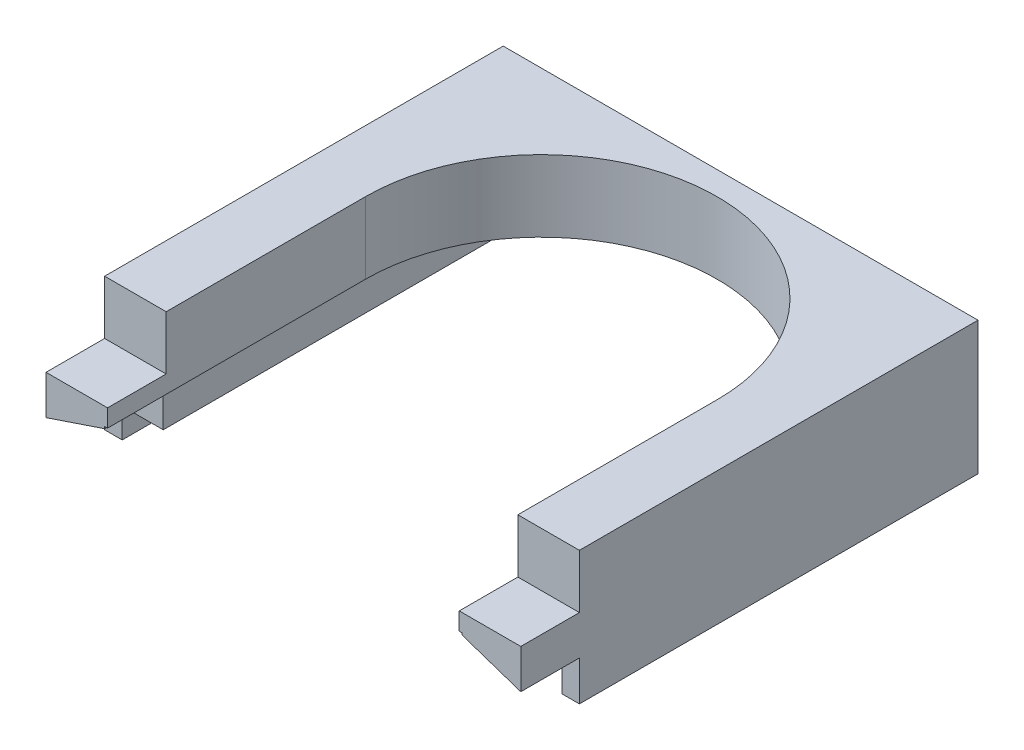
ISO-10303-21;
HEADER;
FILE_DESCRIPTION(('STEP AP214'),'2;1');
FILE_NAME('part.step','',(''),(''),'','','');
FILE_SCHEMA(('AUTOMOTIVE_DESIGN { 1 0 10303 214 1 1 1 1 }'));
ENDSEC;
DATA;
#1=APPLICATION_CONTEXT('core data for automotive mechanical design processes');
#2=APPLICATION_PROTOCOL_DEFINITION('international standard','automotive_design',2000,#1);
#3=PRODUCT_CONTEXT('',#1,'mechanical');
#4=PRODUCT('Part','Part','',(#3));
#5=PRODUCT_RELATED_PRODUCT_CATEGORY('part','',(#4));
#6=PRODUCT_DEFINITION_FORMATION('','',#4);
#7=PRODUCT_DEFINITION_CONTEXT('part definition',#1,'design');
#8=PRODUCT_DEFINITION('design','',#6,#7);
#9=PRODUCT_DEFINITION_SHAPE('','',#8);
#10=(LENGTH_UNIT() NAMED_UNIT(*) SI_UNIT(.MILLI.,.METRE.));
#11=(NAMED_UNIT(*) PLANE_ANGLE_UNIT() SI_UNIT($,.RADIAN.));
#12=(NAMED_UNIT(*) SI_UNIT($,.STERADIAN.) SOLID_ANGLE_UNIT());
#13=UNCERTAINTY_MEASURE_WITH_UNIT(LENGTH_MEASURE(1.E-05),#10,'distance_accuracy_value','');
#14=(GEOMETRIC_REPRESENTATION_CONTEXT(3) GLOBAL_UNCERTAINTY_ASSIGNED_CONTEXT((#13)) GLOBAL_UNIT_ASSIGNED_CONTEXT((#10,
#11,#12)) REPRESENTATION_CONTEXT('',''));
#15=CARTESIAN_POINT('',(0.,0.,0.));
#16=DIRECTION('',(0.,0.,1.));
#17=DIRECTION('',(1.,0.,0.));
#18=AXIS2_PLACEMENT_3D('',#15,#16,#17);
#19=CARTESIAN_POINT('',(0.,0.,68.));
#20=DIRECTION('',(0.,0.,1.));
#21=DIRECTION('',(1.,0.,0.));
#22=AXIS2_PLACEMENT_3D('',#19,#20,#21);
#23=PLANE('',#22);
#24=DIRECTION('',(0.,1.,0.));
#25=VECTOR('',#24,1.);
#26=CARTESIAN_POINT('',(45.4961328011552,12.2,68.));
#27=LINE('',#26,#25);
#28=CARTESIAN_POINT('',(45.4961328011552,-10.5,68.));
#29=VERTEX_POINT('',#28);
#30=CARTESIAN_POINT('',(45.4961328011552,-3.7,68.));
#31=VERTEX_POINT('',#30);
#32=EDGE_CURVE('E290',#29,#31,#27,.T.);
#33=ORIENTED_EDGE('',*,*,#32,.T.);
#34=DIRECTION('',(0.947867298578199,-0.318665317042924,0.));
#35=VECTOR('',#34,1.);
#36=CARTESIAN_POINT('',(45.4961328011552,-3.7,68.));
#37=LINE('',#36,#35);
#38=CARTESIAN_POINT('',(35.4961328011552,-0.338080905197157,68.));
#39=VERTEX_POINT('',#38);
#40=EDGE_CURVE('E220',#39,#31,#37,.T.);
#41=ORIENTED_EDGE('',*,*,#40,.F.);
#42=DIRECTION('',(0.,-1.,0.));
#43=VECTOR('',#42,1.);
#44=CARTESIAN_POINT('',(35.4961328011552,0.,68.));
#45=LINE('',#44,#43);
#46=CARTESIAN_POINT('',(35.4961328011552,-5.49999999999999,68.));
#47=VERTEX_POINT('',#46);
#48=EDGE_CURVE('E281',#39,#47,#45,.T.);
#49=ORIENTED_EDGE('',*,*,#48,.T.);
#50=DIRECTION('',(1.,0.,0.));
#51=VECTOR('',#50,1.);
#52=CARTESIAN_POINT('',(35.4961328011552,-5.49999999999999,68.));
#53=LINE('',#52,#51);
#54=CARTESIAN_POINT('',(42.4961328011552,-5.49999999999999,68.));
#55=VERTEX_POINT('',#54);
#56=EDGE_CURVE('E283',#47,#55,#53,.T.);
#57=ORIENTED_EDGE('',*,*,#56,.T.);
#58=DIRECTION('',(0.,-1.,0.));
#59=VECTOR('',#58,1.);
#60=CARTESIAN_POINT('',(42.4961328011552,-10.5,68.));
#61=LINE('',#60,#59);
#62=CARTESIAN_POINT('',(42.4961328011552,-10.5,68.));
#63=VERTEX_POINT('',#62);
#64=EDGE_CURVE('E285',#55,#63,#61,.T.);
#65=ORIENTED_EDGE('',*,*,#64,.T.);
#66=DIRECTION('',(1.,0.,0.));
#67=VECTOR('',#66,1.);
#68=CARTESIAN_POINT('',(45.4961328011552,-10.5,68.));
#69=LINE('',#68,#67);
#70=EDGE_CURVE('E287',#63,#29,#69,.T.);
#71=ORIENTED_EDGE('',*,*,#70,.T.);
#72=EDGE_LOOP('',(#33,#41,#49,#57,#65,#71));
#73=FACE_BOUND('',#72,.T.);
#74=ADVANCED_FACE('F34',(#73),#23,.T.);
#75=DIRECTION('',(0.,1.,0.));
#76=VECTOR('',#75,1.);
#77=CARTESIAN_POINT('',(34.9961328011552,0.,68.));
#78=LINE('',#77,#76);
#79=CARTESIAN_POINT('',(34.9961328011552,3.,68.));
#80=VERTEX_POINT('',#79);
#81=CARTESIAN_POINT('',(34.9961328011552,12.2,68.));
#82=VERTEX_POINT('',#81);
#83=EDGE_CURVE('E11',#80,#82,#78,.T.);
#84=ORIENTED_EDGE('',*,*,#83,.F.);
#85=DIRECTION('',(-1.,0.,0.));
#86=VECTOR('',#85,1.);
#87=CARTESIAN_POINT('',(45.4961328011552,3.,68.));
#88=LINE('',#87,#86);
#89=CARTESIAN_POINT('',(45.4961328011552,3.,68.));
#90=VERTEX_POINT('',#89);
#91=EDGE_CURVE('E216',#90,#80,#88,.T.);
#92=ORIENTED_EDGE('',*,*,#91,.F.);
#93=CARTESIAN_POINT('',(45.4961328011552,12.2,68.));
#94=VERTEX_POINT('',#93);
#95=EDGE_CURVE('E289',#90,#94,#27,.T.);
#96=ORIENTED_EDGE('',*,*,#95,.T.);
#97=DIRECTION('',(-1.,0.,0.));
#98=VECTOR('',#97,1.);
#99=CARTESIAN_POINT('',(-35.5038671988448,12.2,68.));
#100=LINE('',#99,#98);
#101=EDGE_CURVE('E293',#94,#82,#100,.T.);
#102=ORIENTED_EDGE('',*,*,#101,.T.);
#103=EDGE_LOOP('',(#84,#92,#96,#102));
#104=FACE_BOUND('',#103,.T.);
#105=ADVANCED_FACE('F467',(#104),#23,.T.);
#106=DIRECTION('',(0.,-1.,0.));
#107=VECTOR('',#106,1.);
#108=CARTESIAN_POINT('',(-35.5038671988448,-10.5,68.));
#109=LINE('',#108,#107);
#110=CARTESIAN_POINT('',(-35.5038671988448,12.2,68.));
#111=VERTEX_POINT('',#110);
#112=CARTESIAN_POINT('',(-35.5038671988448,3.,68.));
#113=VERTEX_POINT('',#112);
#114=EDGE_CURVE('E297',#111,#113,#109,.T.);
#115=ORIENTED_EDGE('',*,*,#114,.T.);
#116=DIRECTION('',(-1.,0.,0.));
#117=VECTOR('',#116,1.);
#118=CARTESIAN_POINT('',(-35.5038671988448,3.,68.));
#119=LINE('',#118,#117);
#120=CARTESIAN_POINT('',(-25.0038671988448,3.,68.));
#121=VERTEX_POINT('',#120);
#122=EDGE_CURVE('E222',#121,#113,#119,.T.);
#123=ORIENTED_EDGE('',*,*,#122,.F.);
#124=DIRECTION('',(0.,-1.,0.));
#125=VECTOR('',#124,1.);
#126=CARTESIAN_POINT('',(-25.0038671988448,0.,68.));
#127=LINE('',#126,#125);
#128=CARTESIAN_POINT('',(-25.0038671988448,12.2,68.));
#129=VERTEX_POINT('',#128);
#130=EDGE_CURVE('E42',#129,#121,#127,.T.);
#131=ORIENTED_EDGE('',*,*,#130,.F.);
#132=EDGE_CURVE('E292',#129,#111,#100,.T.);
#133=ORIENTED_EDGE('',*,*,#132,.T.);
#134=EDGE_LOOP('',(#115,#123,#131,#133));
#135=FACE_BOUND('',#134,.T.);
#136=ADVANCED_FACE('F369',(#135),#23,.T.);
#137=DIRECTION('',(0.,1.,0.));
#138=VECTOR('',#137,1.);
#139=CARTESIAN_POINT('',(-25.5038671988448,-5.5,68.));
#140=LINE('',#139,#138);
#141=CARTESIAN_POINT('',(-25.5038671988448,-5.5,68.));
#142=VERTEX_POINT('',#141);
#143=CARTESIAN_POINT('',(-25.5038671988448,-0.338080905197157,68.));
#144=VERTEX_POINT('',#143);
#145=EDGE_CURVE('E277',#142,#144,#140,.T.);
#146=ORIENTED_EDGE('',*,*,#145,.T.);
#147=DIRECTION('',(0.947867298578199,0.318665317042924,0.));
#148=VECTOR('',#147,1.);
#149=CARTESIAN_POINT('',(-35.5038671988448,-3.7,68.));
#150=LINE('',#149,#148);
#151=CARTESIAN_POINT('',(-35.5038671988448,-3.7,68.));
#152=VERTEX_POINT('',#151);
#153=EDGE_CURVE('E224',#152,#144,#150,.T.);
#154=ORIENTED_EDGE('',*,*,#153,.F.);
#155=CARTESIAN_POINT('',(-35.5038671988448,-10.5,68.));
#156=VERTEX_POINT('',#155);
#157=EDGE_CURVE('E296',#152,#156,#109,.T.);
#158=ORIENTED_EDGE('',*,*,#157,.T.);
#159=DIRECTION('',(1.,0.,0.));
#160=VECTOR('',#159,1.);
#161=CARTESIAN_POINT('',(-32.5038671988448,-10.5,68.));
#162=LINE('',#161,#160);
#163=CARTESIAN_POINT('',(-32.5038671988448,-10.5,68.));
#164=VERTEX_POINT('',#163);
#165=EDGE_CURVE('E300',#156,#164,#162,.T.);
#166=ORIENTED_EDGE('',*,*,#165,.T.);
#167=DIRECTION('',(0.,1.,0.));
#168=VECTOR('',#167,1.);
#169=CARTESIAN_POINT('',(-32.5038671988448,-5.5,68.));
#170=LINE('',#169,#168);
#171=CARTESIAN_POINT('',(-32.5038671988448,-5.5,68.));
#172=VERTEX_POINT('',#171);
#173=EDGE_CURVE('E302',#164,#172,#170,.T.);
#174=ORIENTED_EDGE('',*,*,#173,.T.);
#175=DIRECTION('',(1.,0.,0.));
#176=VECTOR('',#175,1.);
#177=CARTESIAN_POINT('',(-32.5038671988448,-5.5,68.));
#178=LINE('',#177,#176);
#179=EDGE_CURVE('E274',#172,#142,#178,.T.);
#180=ORIENTED_EDGE('',*,*,#179,.T.);
#181=EDGE_LOOP('',(#146,#154,#158,#166,#174,#180));
#182=FACE_BOUND('',#181,.T.);
#183=ADVANCED_FACE('F442',(#182),#23,.T.);
#184=CARTESIAN_POINT('',(-32.5038671988448,-5.5,68.));
#185=DIRECTION('',(0.,1.,0.));
#186=DIRECTION('',(0.,0.,1.));
#187=AXIS2_PLACEMENT_3D('',#184,#185,#186);
#188=PLANE('',#187);
#189=DIRECTION('',(1.,0.,0.));
#190=VECTOR('',#189,1.);
#191=CARTESIAN_POINT('',(-32.5038671988448,-5.5,0.));
#192=LINE('',#191,#190);
#193=CARTESIAN_POINT('',(-32.5038671988448,-5.5,0.));
#194=VERTEX_POINT('',#193);
#195=CARTESIAN_POINT('',(-25.5038671988448,-5.5,0.));
#196=VERTEX_POINT('',#195);
#197=EDGE_CURVE('E273',#194,#196,#192,.T.);
#198=ORIENTED_EDGE('',*,*,#197,.T.);
#199=DIRECTION('',(0.,0.,-1.));
#200=VECTOR('',#199,1.);
#201=CARTESIAN_POINT('',(-25.5038671988448,-5.5,68.));
#202=LINE('',#201,#200);
#203=EDGE_CURVE('E360',#142,#196,#202,.T.);
#204=ORIENTED_EDGE('',*,*,#203,.F.);
#205=ORIENTED_EDGE('',*,*,#179,.F.);
#206=DIRECTION('',(0.,0.,-1.));
#207=VECTOR('',#206,1.);
#208=CARTESIAN_POINT('',(-32.5038671988448,-5.5,68.));
#209=LINE('',#208,#207);
#210=EDGE_CURVE('E304',#172,#194,#209,.T.);
#211=ORIENTED_EDGE('',*,*,#210,.T.);
#212=EDGE_LOOP('',(#198,#204,#205,#211));
#213=FACE_BOUND('',#212,.T.);
#214=ADVANCED_FACE('F36',(#213),#188,.F.);
#215=CARTESIAN_POINT('',(-25.5038671988448,-5.5,68.));
#216=DIRECTION('',(-1.,0.,0.));
#217=DIRECTION('',(0.,0.,1.));
#218=AXIS2_PLACEMENT_3D('',#215,#216,#217);
#219=PLANE('',#218);
#220=DIRECTION('',(0.,1.,0.));
#221=VECTOR('',#220,1.);
#222=CARTESIAN_POINT('',(-25.5038671988448,-5.5,0.));
#223=LINE('',#222,#221);
#224=CARTESIAN_POINT('',(-25.5038671988448,0.,0.));
#225=VERTEX_POINT('',#224);
#226=EDGE_CURVE('E307',#196,#225,#223,.T.);
#227=ORIENTED_EDGE('',*,*,#226,.T.);
#228=DIRECTION('',(0.,0.,-1.));
#229=VECTOR('',#228,1.);
#230=CARTESIAN_POINT('',(-25.5038671988448,0.,68.));
#231=LINE('',#230,#229);
#232=CARTESIAN_POINT('',(-25.5038671988448,0.,78.));
#233=VERTEX_POINT('',#232);
#234=EDGE_CURVE('E357',#233,#225,#231,.T.);
#235=ORIENTED_EDGE('',*,*,#234,.F.);
#236=DIRECTION('',(0.,1.,0.));
#237=VECTOR('',#236,1.);
#238=CARTESIAN_POINT('',(-25.5038671988448,-0.338080905197157,78.));
#239=LINE('',#238,#237);
#240=CARTESIAN_POINT('',(-25.5038671988448,-0.338080905197157,78.));
#241=VERTEX_POINT('',#240);
#242=EDGE_CURVE('E229',#241,#233,#239,.T.);
#243=ORIENTED_EDGE('',*,*,#242,.F.);
#244=DIRECTION('',(0.,0.,-1.));
#245=VECTOR('',#244,1.);
#246=CARTESIAN_POINT('',(-25.5038671988448,-0.338080905197157,78.));
#247=LINE('',#246,#245);
#248=EDGE_CURVE('E242',#241,#144,#247,.T.);
#249=ORIENTED_EDGE('',*,*,#248,.T.);
#250=ORIENTED_EDGE('',*,*,#145,.F.);
#251=ORIENTED_EDGE('',*,*,#203,.T.);
#252=EDGE_LOOP('',(#227,#235,#243,#249,#250,#251));
#253=FACE_BOUND('',#252,.T.);
#254=ADVANCED_FACE('F451',(#253),#219,.F.);
#255=CARTESIAN_POINT('',(-25.5038671988448,0.,68.));
#256=DIRECTION('',(0.,1.,0.));
#257=DIRECTION('',(0.,0.,1.));
#258=AXIS2_PLACEMENT_3D('',#255,#256,#257);
#259=PLANE('',#258);
#260=DIRECTION('',(0.,0.,-1.));
#261=VECTOR('',#260,1.);
#262=CARTESIAN_POINT('',(35.4961328011552,0.,68.));
#263=LINE('',#262,#261);
#264=CARTESIAN_POINT('',(35.4961328011552,0.,78.));
#265=VERTEX_POINT('',#264);
#266=CARTESIAN_POINT('',(35.4961328011552,0.,0.));
#267=VERTEX_POINT('',#266);
#268=EDGE_CURVE('E354',#265,#267,#263,.T.);
#269=ORIENTED_EDGE('',*,*,#268,.F.);
#270=DIRECTION('',(1.,0.,0.));
#271=VECTOR('',#270,1.);
#272=CARTESIAN_POINT('',(34.9961328011552,0.,78.));
#273=LINE('',#272,#271);
#274=CARTESIAN_POINT('',(34.9961328011552,0.,78.));
#275=VERTEX_POINT('',#274);
#276=EDGE_CURVE('E394',#275,#265,#273,.T.);
#277=ORIENTED_EDGE('',*,*,#276,.F.);
#278=DIRECTION('',(0.,0.,-1.));
#279=VECTOR('',#278,1.);
#280=CARTESIAN_POINT('',(34.9961328011552,0.,68.));
#281=LINE('',#280,#279);
#282=CARTESIAN_POINT('',(34.9961328011552,0.,34.));
#283=VERTEX_POINT('',#282);
#284=EDGE_CURVE('E267',#275,#283,#281,.T.);
#285=ORIENTED_EDGE('',*,*,#284,.T.);
#286=CARTESIAN_POINT('',(4.9961328011552,0.,34.));
#287=DIRECTION('',(0.,1.,0.));
#288=DIRECTION('',(0.,0.,1.));
#289=AXIS2_PLACEMENT_3D('',#286,#287,#288);
#290=CIRCLE('',#289,30.);
#291=CARTESIAN_POINT('',(-25.0038671988448,0.,34.));
#292=VERTEX_POINT('',#291);
#293=EDGE_CURVE('E270',#283,#292,#290,.T.);
#294=ORIENTED_EDGE('',*,*,#293,.T.);
#295=DIRECTION('',(0.,0.,1.));
#296=VECTOR('',#295,1.);
#297=CARTESIAN_POINT('',(-25.0038671988448,0.,68.));
#298=LINE('',#297,#296);
#299=CARTESIAN_POINT('',(-25.0038671988448,0.,78.));
#300=VERTEX_POINT('',#299);
#301=EDGE_CURVE('E264',#292,#300,#298,.T.);
#302=ORIENTED_EDGE('',*,*,#301,.T.);
#303=DIRECTION('',(1.,0.,0.));
#304=VECTOR('',#303,1.);
#305=CARTESIAN_POINT('',(-25.0038671988448,0.,78.));
#306=LINE('',#305,#304);
#307=EDGE_CURVE('E232',#233,#300,#306,.T.);
#308=ORIENTED_EDGE('',*,*,#307,.F.);
#309=ORIENTED_EDGE('',*,*,#234,.T.);
#310=DIRECTION('',(1.,0.,0.));
#311=VECTOR('',#310,1.);
#312=CARTESIAN_POINT('',(-25.5038671988448,0.,0.));
#313=LINE('',#312,#311);
#314=EDGE_CURVE('E309',#225,#267,#313,.T.);
#315=ORIENTED_EDGE('',*,*,#314,.T.);
#316=EDGE_LOOP('',(#269,#277,#285,#294,#302,#308,#309,#315));
#317=FACE_BOUND('',#316,.T.);
#318=ADVANCED_FACE('F392',(#317),#259,.F.);
#319=CARTESIAN_POINT('',(35.4961328011552,0.,68.));
#320=DIRECTION('',(1.,0.,0.));
#321=DIRECTION('',(0.,0.,-1.));
#322=AXIS2_PLACEMENT_3D('',#319,#320,#321);
#323=PLANE('',#322);
#324=DIRECTION('',(0.,-1.,0.));
#325=VECTOR('',#324,1.);
#326=CARTESIAN_POINT('',(35.4961328011552,0.,0.));
#327=LINE('',#326,#325);
#328=CARTESIAN_POINT('',(35.4961328011552,-5.49999999999999,0.));
#329=VERTEX_POINT('',#328);
#330=EDGE_CURVE('E311',#267,#329,#327,.T.);
#331=ORIENTED_EDGE('',*,*,#330,.T.);
#332=DIRECTION('',(0.,0.,-1.));
#333=VECTOR('',#332,1.);
#334=CARTESIAN_POINT('',(35.4961328011552,-5.49999999999999,68.));
#335=LINE('',#334,#333);
#336=EDGE_CURVE('E351',#47,#329,#335,.T.);
#337=ORIENTED_EDGE('',*,*,#336,.F.);
#338=ORIENTED_EDGE('',*,*,#48,.F.);
#339=DIRECTION('',(0.,0.,-1.));
#340=VECTOR('',#339,1.);
#341=CARTESIAN_POINT('',(35.4961328011552,-0.338080905197157,78.));
#342=LINE('',#341,#340);
#343=CARTESIAN_POINT('',(35.4961328011552,-0.338080905197157,78.));
#344=VERTEX_POINT('',#343);
#345=EDGE_CURVE('E403',#344,#39,#342,.T.);
#346=ORIENTED_EDGE('',*,*,#345,.F.);
#347=DIRECTION('',(0.,-1.,0.));
#348=VECTOR('',#347,1.);
#349=CARTESIAN_POINT('',(35.4961328011552,-0.338080905197157,78.));
#350=LINE('',#349,#348);
#351=EDGE_CURVE('E213',#265,#344,#350,.T.);
#352=ORIENTED_EDGE('',*,*,#351,.F.);
#353=ORIENTED_EDGE('',*,*,#268,.T.);
#354=EDGE_LOOP('',(#331,#337,#338,#346,#352,#353));
#355=FACE_BOUND('',#354,.T.);
#356=ADVANCED_FACE('F410',(#355),#323,.F.);
#357=CARTESIAN_POINT('',(35.4961328011552,-5.49999999999999,68.));
#358=DIRECTION('',(0.,1.,0.));
#359=DIRECTION('',(0.,0.,1.));
#360=AXIS2_PLACEMENT_3D('',#357,#358,#359);
#361=PLANE('',#360);
#362=DIRECTION('',(1.,0.,0.));
#363=VECTOR('',#362,1.);
#364=CARTESIAN_POINT('',(35.4961328011552,-5.49999999999999,0.));
#365=LINE('',#364,#363);
#366=CARTESIAN_POINT('',(42.4961328011552,-5.49999999999999,0.));
#367=VERTEX_POINT('',#366);
#368=EDGE_CURVE('E313',#329,#367,#365,.T.);
#369=ORIENTED_EDGE('',*,*,#368,.T.);
#370=DIRECTION('',(0.,0.,-1.));
#371=VECTOR('',#370,1.);
#372=CARTESIAN_POINT('',(42.4961328011552,-5.49999999999999,68.));
#373=LINE('',#372,#371);
#374=EDGE_CURVE('E348',#55,#367,#373,.T.);
#375=ORIENTED_EDGE('',*,*,#374,.F.);
#376=ORIENTED_EDGE('',*,*,#56,.F.);
#377=ORIENTED_EDGE('',*,*,#336,.T.);
#378=EDGE_LOOP('',(#369,#375,#376,#377));
#379=FACE_BOUND('',#378,.T.);
#380=ADVANCED_FACE('F416',(#379),#361,.F.);
#381=CARTESIAN_POINT('',(42.4961328011552,-10.5,68.));
#382=DIRECTION('',(1.,0.,0.));
#383=DIRECTION('',(0.,0.,-1.));
#384=AXIS2_PLACEMENT_3D('',#381,#382,#383);
#385=PLANE('',#384);
#386=DIRECTION('',(0.,-1.,0.));
#387=VECTOR('',#386,1.);
#388=CARTESIAN_POINT('',(42.4961328011552,-10.5,0.));
#389=LINE('',#388,#387);
#390=CARTESIAN_POINT('',(42.4961328011552,-10.5,0.));
#391=VERTEX_POINT('',#390);
#392=EDGE_CURVE('E315',#367,#391,#389,.T.);
#393=ORIENTED_EDGE('',*,*,#392,.T.);
#394=DIRECTION('',(0.,0.,-1.));
#395=VECTOR('',#394,1.);
#396=CARTESIAN_POINT('',(42.4961328011552,-10.5,68.));
#397=LINE('',#396,#395);
#398=EDGE_CURVE('E345',#63,#391,#397,.T.);
#399=ORIENTED_EDGE('',*,*,#398,.F.);
#400=ORIENTED_EDGE('',*,*,#64,.F.);
#401=ORIENTED_EDGE('',*,*,#374,.T.);
#402=EDGE_LOOP('',(#393,#399,#400,#401));
#403=FACE_BOUND('',#402,.T.);
#404=ADVANCED_FACE('F422',(#403),#385,.F.);
#405=CARTESIAN_POINT('',(45.4961328011552,-10.5,68.));
#406=DIRECTION('',(0.,1.,0.));
#407=DIRECTION('',(0.,0.,1.));
#408=AXIS2_PLACEMENT_3D('',#405,#406,#407);
#409=PLANE('',#408);
#410=DIRECTION('',(1.,0.,0.));
#411=VECTOR('',#410,1.);
#412=CARTESIAN_POINT('',(45.4961328011552,-10.5,0.));
#413=LINE('',#412,#411);
#414=CARTESIAN_POINT('',(45.4961328011552,-10.5,0.));
#415=VERTEX_POINT('',#414);
#416=EDGE_CURVE('E317',#391,#415,#413,.T.);
#417=ORIENTED_EDGE('',*,*,#416,.T.);
#418=DIRECTION('',(0.,0.,-1.));
#419=VECTOR('',#418,1.);
#420=CARTESIAN_POINT('',(45.4961328011552,-10.5,68.));
#421=LINE('',#420,#419);
#422=EDGE_CURVE('E342',#29,#415,#421,.T.);
#423=ORIENTED_EDGE('',*,*,#422,.F.);
#424=ORIENTED_EDGE('',*,*,#70,.F.);
#425=ORIENTED_EDGE('',*,*,#398,.T.);
#426=EDGE_LOOP('',(#417,#423,#424,#425));
#427=FACE_BOUND('',#426,.T.);
#428=ADVANCED_FACE('F426',(#427),#409,.F.);
#429=CARTESIAN_POINT('',(45.4961328011552,12.2,68.));
#430=DIRECTION('',(-1.,0.,0.));
#431=DIRECTION('',(0.,0.,1.));
#432=AXIS2_PLACEMENT_3D('',#429,#430,#431);
#433=PLANE('',#432);
#434=DIRECTION('',(0.,1.,0.));
#435=VECTOR('',#434,1.);
#436=CARTESIAN_POINT('',(45.4961328011552,12.2,0.));
#437=LINE('',#436,#435);
#438=CARTESIAN_POINT('',(45.4961328011552,12.2,0.));
#439=VERTEX_POINT('',#438);
#440=EDGE_CURVE('E319',#415,#439,#437,.T.);
#441=ORIENTED_EDGE('',*,*,#440,.T.);
#442=DIRECTION('',(0.,0.,-1.));
#443=VECTOR('',#442,1.);
#444=CARTESIAN_POINT('',(45.4961328011552,12.2,68.));
#445=LINE('',#444,#443);
#446=EDGE_CURVE('E339',#94,#439,#445,.T.);
#447=ORIENTED_EDGE('',*,*,#446,.F.);
#448=ORIENTED_EDGE('',*,*,#95,.F.);
#449=DIRECTION('',(0.,0.,-1.));
#450=VECTOR('',#449,1.);
#451=CARTESIAN_POINT('',(45.4961328011552,3.,78.));
#452=LINE('',#451,#450);
#453=CARTESIAN_POINT('',(45.4961328011552,3.,78.));
#454=VERTEX_POINT('',#453);
#455=EDGE_CURVE('E203',#454,#90,#452,.T.);
#456=ORIENTED_EDGE('',*,*,#455,.F.);
#457=DIRECTION('',(0.,1.,0.));
#458=VECTOR('',#457,1.);
#459=CARTESIAN_POINT('',(45.4961328011552,-3.7,78.));
#460=LINE('',#459,#458);
#461=CARTESIAN_POINT('',(45.4961328011552,-3.7,78.));
#462=VERTEX_POINT('',#461);
#463=EDGE_CURVE('E195',#462,#454,#460,.T.);
#464=ORIENTED_EDGE('',*,*,#463,.F.);
#465=DIRECTION('',(0.,0.,-1.));
#466=VECTOR('',#465,1.);
#467=CARTESIAN_POINT('',(45.4961328011552,-3.7,78.));
#468=LINE('',#467,#466);
#469=EDGE_CURVE('E200',#462,#31,#468,.T.);
#470=ORIENTED_EDGE('',*,*,#469,.T.);
#471=ORIENTED_EDGE('',*,*,#32,.F.);
#472=ORIENTED_EDGE('',*,*,#422,.T.);
#473=EDGE_LOOP('',(#441,#447,#448,#456,#464,#470,#471,#472));
#474=FACE_BOUND('',#473,.T.);
#475=ADVANCED_FACE('F197',(#474),#433,.F.);
#476=CARTESIAN_POINT('',(-35.5038671988448,12.2,68.));
#477=DIRECTION('',(0.,-1.,0.));
#478=DIRECTION('',(1.,0.,0.));
#479=AXIS2_PLACEMENT_3D('',#476,#477,#478);
#480=PLANE('',#479);
#481=CARTESIAN_POINT('',(4.9961328011552,12.2,34.));
#482=DIRECTION('',(0.,1.,0.));
#483=DIRECTION('',(-1.,0.,0.));
#484=AXIS2_PLACEMENT_3D('',#481,#482,#483);
#485=CIRCLE('',#484,30.);
#486=CARTESIAN_POINT('',(34.9961328011552,12.2,34.));
#487=VERTEX_POINT('',#486);
#488=CARTESIAN_POINT('',(-25.0038671988448,12.2,34.));
#489=VERTEX_POINT('',#488);
#490=EDGE_CURVE('E254',#487,#489,#485,.T.);
#491=ORIENTED_EDGE('',*,*,#490,.F.);
#492=DIRECTION('',(0.,0.,-1.));
#493=VECTOR('',#492,1.);
#494=CARTESIAN_POINT('',(34.9961328011552,12.2,68.));
#495=LINE('',#494,#493);
#496=EDGE_CURVE('E258',#82,#487,#495,.T.);
#497=ORIENTED_EDGE('',*,*,#496,.F.);
#498=ORIENTED_EDGE('',*,*,#101,.F.);
#499=ORIENTED_EDGE('',*,*,#446,.T.);
#500=DIRECTION('',(-1.,0.,0.));
#501=VECTOR('',#500,1.);
#502=CARTESIAN_POINT('',(-35.5038671988448,12.2,0.));
#503=LINE('',#502,#501);
#504=CARTESIAN_POINT('',(-35.5038671988448,12.2,0.));
#505=VERTEX_POINT('',#504);
#506=EDGE_CURVE('E321',#439,#505,#503,.T.);
#507=ORIENTED_EDGE('',*,*,#506,.T.);
#508=DIRECTION('',(0.,0.,-1.));
#509=VECTOR('',#508,1.);
#510=CARTESIAN_POINT('',(-35.5038671988448,12.2,68.));
#511=LINE('',#510,#509);
#512=EDGE_CURVE('E336',#111,#505,#511,.T.);
#513=ORIENTED_EDGE('',*,*,#512,.F.);
#514=ORIENTED_EDGE('',*,*,#132,.F.);
#515=DIRECTION('',(0.,0.,1.));
#516=VECTOR('',#515,1.);
#517=CARTESIAN_POINT('',(-25.0038671988448,12.2,34.));
#518=LINE('',#517,#516);
#519=EDGE_CURVE('E56',#489,#129,#518,.T.);
#520=ORIENTED_EDGE('',*,*,#519,.F.);
#521=EDGE_LOOP('',(#491,#497,#498,#499,#507,#513,#514,#520));
#522=FACE_BOUND('',#521,.T.);
#523=ADVANCED_FACE('F373',(#522),#480,.F.);
#524=CARTESIAN_POINT('',(-35.5038671988448,-10.5,68.));
#525=DIRECTION('',(1.,0.,0.));
#526=DIRECTION('',(0.,0.,-1.));
#527=AXIS2_PLACEMENT_3D('',#524,#525,#526);
#528=PLANE('',#527);
#529=DIRECTION('',(0.,-1.,0.));
#530=VECTOR('',#529,1.);
#531=CARTESIAN_POINT('',(-35.5038671988448,-10.5,0.));
#532=LINE('',#531,#530);
#533=CARTESIAN_POINT('',(-35.5038671988448,-10.5,0.));
#534=VERTEX_POINT('',#533);
#535=EDGE_CURVE('E323',#505,#534,#532,.T.);
#536=ORIENTED_EDGE('',*,*,#535,.T.);
#537=DIRECTION('',(0.,0.,-1.));
#538=VECTOR('',#537,1.);
#539=CARTESIAN_POINT('',(-35.5038671988448,-10.5,68.));
#540=LINE('',#539,#538);
#541=EDGE_CURVE('E333',#156,#534,#540,.T.);
#542=ORIENTED_EDGE('',*,*,#541,.F.);
#543=ORIENTED_EDGE('',*,*,#157,.F.);
#544=DIRECTION('',(0.,0.,-1.));
#545=VECTOR('',#544,1.);
#546=CARTESIAN_POINT('',(-35.5038671988448,-3.7,78.));
#547=LINE('',#546,#545);
#548=CARTESIAN_POINT('',(-35.5038671988448,-3.7,78.));
#549=VERTEX_POINT('',#548);
#550=EDGE_CURVE('E247',#549,#152,#547,.T.);
#551=ORIENTED_EDGE('',*,*,#550,.F.);
#552=DIRECTION('',(0.,-1.,0.));
#553=VECTOR('',#552,1.);
#554=CARTESIAN_POINT('',(-35.5038671988448,-3.7,78.));
#555=LINE('',#554,#553);
#556=CARTESIAN_POINT('',(-35.5038671988448,3.,78.));
#557=VERTEX_POINT('',#556);
#558=EDGE_CURVE('E239',#557,#549,#555,.T.);
#559=ORIENTED_EDGE('',*,*,#558,.F.);
#560=DIRECTION('',(0.,0.,-1.));
#561=VECTOR('',#560,1.);
#562=CARTESIAN_POINT('',(-35.5038671988448,3.,78.));
#563=LINE('',#562,#561);
#564=EDGE_CURVE('E249',#557,#113,#563,.T.);
#565=ORIENTED_EDGE('',*,*,#564,.T.);
#566=ORIENTED_EDGE('',*,*,#114,.F.);
#567=ORIENTED_EDGE('',*,*,#512,.T.);
#568=EDGE_LOOP('',(#536,#542,#543,#551,#559,#565,#566,#567));
#569=FACE_BOUND('',#568,.T.);
#570=ADVANCED_FACE('F378',(#569),#528,.F.);
#571=CARTESIAN_POINT('',(-32.5038671988448,-10.5,68.));
#572=DIRECTION('',(0.,1.,0.));
#573=DIRECTION('',(0.,0.,1.));
#574=AXIS2_PLACEMENT_3D('',#571,#572,#573);
#575=PLANE('',#574);
#576=DIRECTION('',(1.,0.,0.));
#577=VECTOR('',#576,1.);
#578=CARTESIAN_POINT('',(-32.5038671988448,-10.5,0.));
#579=LINE('',#578,#577);
#580=CARTESIAN_POINT('',(-32.5038671988448,-10.5,0.));
#581=VERTEX_POINT('',#580);
#582=EDGE_CURVE('E325',#534,#581,#579,.T.);
#583=ORIENTED_EDGE('',*,*,#582,.T.);
#584=DIRECTION('',(0.,0.,-1.));
#585=VECTOR('',#584,1.);
#586=CARTESIAN_POINT('',(-32.5038671988448,-10.5,68.));
#587=LINE('',#586,#585);
#588=EDGE_CURVE('E330',#164,#581,#587,.T.);
#589=ORIENTED_EDGE('',*,*,#588,.F.);
#590=ORIENTED_EDGE('',*,*,#165,.F.);
#591=ORIENTED_EDGE('',*,*,#541,.T.);
#592=EDGE_LOOP('',(#583,#589,#590,#591));
#593=FACE_BOUND('',#592,.T.);
#594=ADVANCED_FACE('F438',(#593),#575,.F.);
#595=CARTESIAN_POINT('',(-32.5038671988448,-5.5,68.));
#596=DIRECTION('',(-1.,0.,0.));
#597=DIRECTION('',(0.,0.,1.));
#598=AXIS2_PLACEMENT_3D('',#595,#596,#597);
#599=PLANE('',#598);
#600=DIRECTION('',(0.,1.,0.));
#601=VECTOR('',#600,1.);
#602=CARTESIAN_POINT('',(-32.5038671988448,-5.5,0.));
#603=LINE('',#602,#601);
#604=EDGE_CURVE('E278',#581,#194,#603,.T.);
#605=ORIENTED_EDGE('',*,*,#604,.T.);
#606=ORIENTED_EDGE('',*,*,#210,.F.);
#607=ORIENTED_EDGE('',*,*,#173,.F.);
#608=ORIENTED_EDGE('',*,*,#588,.T.);
#609=EDGE_LOOP('',(#605,#606,#607,#608));
#610=FACE_BOUND('',#609,.T.);
#611=ADVANCED_FACE('F457',(#610),#599,.F.);
#612=CARTESIAN_POINT('',(0.,0.,0.));
#613=DIRECTION('',(0.,0.,1.));
#614=DIRECTION('',(1.,0.,0.));
#615=AXIS2_PLACEMENT_3D('',#612,#613,#614);
#616=PLANE('',#615);
#617=ORIENTED_EDGE('',*,*,#197,.F.);
#618=ORIENTED_EDGE('',*,*,#604,.F.);
#619=ORIENTED_EDGE('',*,*,#582,.F.);
#620=ORIENTED_EDGE('',*,*,#535,.F.);
#621=ORIENTED_EDGE('',*,*,#506,.F.);
#622=ORIENTED_EDGE('',*,*,#440,.F.);
#623=ORIENTED_EDGE('',*,*,#416,.F.);
#624=ORIENTED_EDGE('',*,*,#392,.F.);
#625=ORIENTED_EDGE('',*,*,#368,.F.);
#626=ORIENTED_EDGE('',*,*,#330,.F.);
#627=ORIENTED_EDGE('',*,*,#314,.F.);
#628=ORIENTED_EDGE('',*,*,#226,.F.);
#629=EDGE_LOOP('',(#617,#618,#619,#620,#621,#622,#623,#624,#625,#626,#627,#628));
#630=FACE_BOUND('',#629,.T.);
#631=ADVANCED_FACE('F431',(#630),#616,.F.);
#632=CARTESIAN_POINT('',(4.9961328011552,-17.8,34.));
#633=DIRECTION('',(0.,1.,0.));
#634=DIRECTION('',(-1.,0.,0.));
#635=AXIS2_PLACEMENT_3D('',#632,#633,#634);
#636=CYLINDRICAL_SURFACE('',#635,30.);
#637=DIRECTION('',(0.,1.,0.));
#638=VECTOR('',#637,1.);
#639=CARTESIAN_POINT('',(34.9961328011552,-17.8,34.));
#640=LINE('',#639,#638);
#641=EDGE_CURVE('E262',#283,#487,#640,.T.);
#642=ORIENTED_EDGE('',*,*,#641,.T.);
#643=ORIENTED_EDGE('',*,*,#490,.T.);
#644=DIRECTION('',(0.,1.,0.));
#645=VECTOR('',#644,1.);
#646=CARTESIAN_POINT('',(-25.0038671988448,-17.8,34.));
#647=LINE('',#646,#645);
#648=EDGE_CURVE('E261',#292,#489,#647,.T.);
#649=ORIENTED_EDGE('',*,*,#648,.F.);
#650=ORIENTED_EDGE('',*,*,#293,.F.);
#651=EDGE_LOOP('',(#642,#643,#649,#650));
#652=FACE_BOUND('',#651,.T.);
#653=ADVANCED_FACE('F390',(#652),#636,.F.);
#654=CARTESIAN_POINT('',(34.9961328011552,-17.8,68.));
#655=DIRECTION('',(1.,0.,0.));
#656=DIRECTION('',(0.,1.,0.));
#657=AXIS2_PLACEMENT_3D('',#654,#655,#656);
#658=PLANE('',#657);
#659=ORIENTED_EDGE('',*,*,#284,.F.);
#660=DIRECTION('',(0.,-1.,0.));
#661=VECTOR('',#660,1.);
#662=CARTESIAN_POINT('',(34.9961328011552,3.,78.));
#663=LINE('',#662,#661);
#664=CARTESIAN_POINT('',(34.9961328011552,3.,78.));
#665=VERTEX_POINT('',#664);
#666=EDGE_CURVE('E397',#665,#275,#663,.T.);
#667=ORIENTED_EDGE('',*,*,#666,.F.);
#668=DIRECTION('',(0.,0.,-1.));
#669=VECTOR('',#668,1.);
#670=CARTESIAN_POINT('',(34.9961328011552,3.,78.));
#671=LINE('',#670,#669);
#672=EDGE_CURVE('E48',#665,#80,#671,.T.);
#673=ORIENTED_EDGE('',*,*,#672,.T.);
#674=ORIENTED_EDGE('',*,*,#83,.T.);
#675=ORIENTED_EDGE('',*,*,#496,.T.);
#676=ORIENTED_EDGE('',*,*,#641,.F.);
#677=EDGE_LOOP('',(#659,#667,#673,#674,#675,#676));
#678=FACE_BOUND('',#677,.T.);
#679=ADVANCED_FACE('F396',(#678),#658,.F.);
#680=CARTESIAN_POINT('',(-25.0038671988448,-17.8,34.));
#681=DIRECTION('',(-1.,0.,0.));
#682=DIRECTION('',(0.,0.,1.));
#683=AXIS2_PLACEMENT_3D('',#680,#681,#682);
#684=PLANE('',#683);
#685=ORIENTED_EDGE('',*,*,#648,.T.);
#686=ORIENTED_EDGE('',*,*,#519,.T.);
#687=ORIENTED_EDGE('',*,*,#130,.T.);
#688=DIRECTION('',(0.,0.,-1.));
#689=VECTOR('',#688,1.);
#690=CARTESIAN_POINT('',(-25.0038671988448,3.,78.));
#691=LINE('',#690,#689);
#692=CARTESIAN_POINT('',(-25.0038671988448,3.,78.));
#693=VERTEX_POINT('',#692);
#694=EDGE_CURVE('E252',#693,#121,#691,.T.);
#695=ORIENTED_EDGE('',*,*,#694,.F.);
#696=DIRECTION('',(0.,1.,0.));
#697=VECTOR('',#696,1.);
#698=CARTESIAN_POINT('',(-25.0038671988448,3.,78.));
#699=LINE('',#698,#697);
#700=EDGE_CURVE('E235',#300,#693,#699,.T.);
#701=ORIENTED_EDGE('',*,*,#700,.F.);
#702=ORIENTED_EDGE('',*,*,#301,.F.);
#703=EDGE_LOOP('',(#685,#686,#687,#695,#701,#702));
#704=FACE_BOUND('',#703,.T.);
#705=ADVANCED_FACE('F363',(#704),#684,.F.);
#706=CARTESIAN_POINT('',(-35.5038671988448,3.,78.));
#707=DIRECTION('',(0.,-1.,0.));
#708=DIRECTION('',(1.,0.,0.));
#709=AXIS2_PLACEMENT_3D('',#706,#707,#708);
#710=PLANE('',#709);
#711=ORIENTED_EDGE('',*,*,#122,.T.);
#712=ORIENTED_EDGE('',*,*,#564,.F.);
#713=DIRECTION('',(-1.,0.,0.));
#714=VECTOR('',#713,1.);
#715=CARTESIAN_POINT('',(-35.5038671988448,3.,78.));
#716=LINE('',#715,#714);
#717=EDGE_CURVE('E237',#693,#557,#716,.T.);
#718=ORIENTED_EDGE('',*,*,#717,.F.);
#719=ORIENTED_EDGE('',*,*,#694,.T.);
#720=EDGE_LOOP('',(#711,#712,#718,#719));
#721=FACE_BOUND('',#720,.T.);
#722=ADVANCED_FACE('F383',(#721),#710,.F.);
#723=CARTESIAN_POINT('',(-35.5038671988448,-3.7,78.));
#724=DIRECTION('',(-0.318665317042924,0.947867298578199,0.));
#725=DIRECTION('',(-0.947867298578199,-0.318665317042924,0.));
#726=AXIS2_PLACEMENT_3D('',#723,#724,#725);
#727=PLANE('',#726);
#728=ORIENTED_EDGE('',*,*,#153,.T.);
#729=ORIENTED_EDGE('',*,*,#248,.F.);
#730=DIRECTION('',(0.947867298578199,0.318665317042924,0.));
#731=VECTOR('',#730,1.);
#732=CARTESIAN_POINT('',(-35.5038671988448,-3.7,78.));
#733=LINE('',#732,#731);
#734=EDGE_CURVE('E241',#549,#241,#733,.T.);
#735=ORIENTED_EDGE('',*,*,#734,.F.);
#736=ORIENTED_EDGE('',*,*,#550,.T.);
#737=EDGE_LOOP('',(#728,#729,#735,#736));
#738=FACE_BOUND('',#737,.T.);
#739=ADVANCED_FACE('F448',(#738),#727,.F.);
#740=CARTESIAN_POINT('',(0.,0.,78.));
#741=DIRECTION('',(0.,0.,1.));
#742=DIRECTION('',(1.,0.,0.));
#743=AXIS2_PLACEMENT_3D('',#740,#741,#742);
#744=PLANE('',#743);
#745=ORIENTED_EDGE('',*,*,#242,.T.);
#746=ORIENTED_EDGE('',*,*,#307,.T.);
#747=ORIENTED_EDGE('',*,*,#700,.T.);
#748=ORIENTED_EDGE('',*,*,#717,.T.);
#749=ORIENTED_EDGE('',*,*,#558,.T.);
#750=ORIENTED_EDGE('',*,*,#734,.T.);
#751=EDGE_LOOP('',(#745,#746,#747,#748,#749,#750));
#752=FACE_BOUND('',#751,.T.);
#753=ADVANCED_FACE('F385',(#752),#744,.T.);
#754=CARTESIAN_POINT('',(45.4961328011552,-3.7,78.));
#755=DIRECTION('',(0.318665317042924,0.947867298578199,0.));
#756=DIRECTION('',(-0.947867298578199,0.318665317042924,0.));
#757=AXIS2_PLACEMENT_3D('',#754,#755,#756);
#758=PLANE('',#757);
#759=ORIENTED_EDGE('',*,*,#40,.T.);
#760=ORIENTED_EDGE('',*,*,#469,.F.);
#761=DIRECTION('',(0.947867298578199,-0.318665317042924,0.));
#762=VECTOR('',#761,1.);
#763=CARTESIAN_POINT('',(45.4961328011552,-3.7,78.));
#764=LINE('',#763,#762);
#765=EDGE_CURVE('E207',#344,#462,#764,.T.);
#766=ORIENTED_EDGE('',*,*,#765,.F.);
#767=ORIENTED_EDGE('',*,*,#345,.T.);
#768=EDGE_LOOP('',(#759,#760,#766,#767));
#769=FACE_BOUND('',#768,.T.);
#770=ADVANCED_FACE('F218',(#769),#758,.F.);
#771=CARTESIAN_POINT('',(45.4961328011552,3.,78.));
#772=DIRECTION('',(0.,-1.,0.));
#773=DIRECTION('',(1.,0.,0.));
#774=AXIS2_PLACEMENT_3D('',#771,#772,#773);
#775=PLANE('',#774);
#776=ORIENTED_EDGE('',*,*,#91,.T.);
#777=ORIENTED_EDGE('',*,*,#672,.F.);
#778=DIRECTION('',(-1.,0.,0.));
#779=VECTOR('',#778,1.);
#780=CARTESIAN_POINT('',(45.4961328011552,3.,78.));
#781=LINE('',#780,#779);
#782=EDGE_CURVE('E206',#454,#665,#781,.T.);
#783=ORIENTED_EDGE('',*,*,#782,.F.);
#784=ORIENTED_EDGE('',*,*,#455,.T.);
#785=EDGE_LOOP('',(#776,#777,#783,#784));
#786=FACE_BOUND('',#785,.T.);
#787=ADVANCED_FACE('F664',(#786),#775,.F.);
#788=CARTESIAN_POINT('',(0.,0.,78.));
#789=DIRECTION('',(0.,0.,-1.));
#790=DIRECTION('',(-1.,0.,0.));
#791=AXIS2_PLACEMENT_3D('',#788,#789,#790);
#792=PLANE('',#791);
#793=ORIENTED_EDGE('',*,*,#765,.T.);
#794=ORIENTED_EDGE('',*,*,#463,.T.);
#795=ORIENTED_EDGE('',*,*,#782,.T.);
#796=ORIENTED_EDGE('',*,*,#666,.T.);
#797=ORIENTED_EDGE('',*,*,#276,.T.);
#798=ORIENTED_EDGE('',*,*,#351,.T.);
#799=EDGE_LOOP('',(#793,#794,#795,#796,#797,#798));
#800=FACE_BOUND('',#799,.T.);
#801=ADVANCED_FACE('F210',(#800),#792,.F.);
#802=CLOSED_SHELL('',(#74,#105,#136,#183,#214,#254,#318,#356,#380,#404,#428,#475,#523,#570,#594,
#611,#631,#653,#679,#705,#722,#739,#753,#770,#787,#801));
#803=MANIFOLD_SOLID_BREP('B2',#802);
#804=ADVANCED_BREP_SHAPE_REPRESENTATION('',(#18,#803),#14);
#805=SHAPE_DEFINITION_REPRESENTATION(#9,#804);
ENDSEC;
END-ISO-10303-21;
